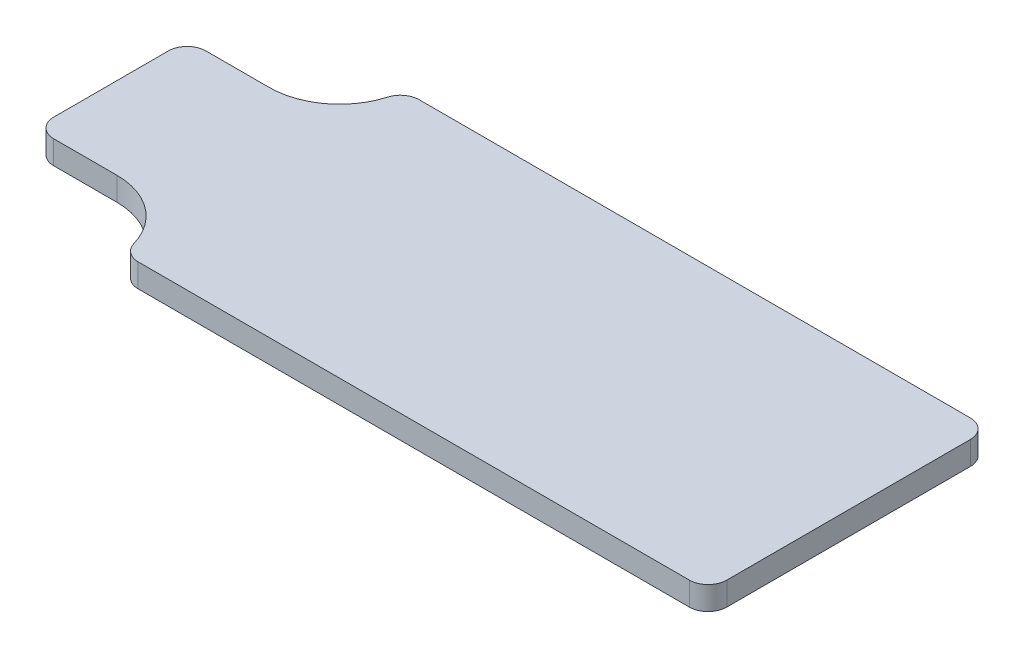
ISO-10303-21;
HEADER;
FILE_DESCRIPTION(('STEP AP214'),'2;1');
FILE_NAME('part.step','',(''),(''),'','','');
FILE_SCHEMA(('AUTOMOTIVE_DESIGN { 1 0 10303 214 1 1 1 1 }'));
ENDSEC;
DATA;
#1=APPLICATION_CONTEXT('core data for automotive mechanical design processes');
#2=APPLICATION_PROTOCOL_DEFINITION('international standard','automotive_design',2000,#1);
#3=PRODUCT_CONTEXT('',#1,'mechanical');
#4=PRODUCT('Part','Part','',(#3));
#5=PRODUCT_RELATED_PRODUCT_CATEGORY('part','',(#4));
#6=PRODUCT_DEFINITION_FORMATION('','',#4);
#7=PRODUCT_DEFINITION_CONTEXT('part definition',#1,'design');
#8=PRODUCT_DEFINITION('design','',#6,#7);
#9=PRODUCT_DEFINITION_SHAPE('','',#8);
#10=(LENGTH_UNIT() NAMED_UNIT(*) SI_UNIT(.MILLI.,.METRE.));
#11=(NAMED_UNIT(*) PLANE_ANGLE_UNIT() SI_UNIT($,.RADIAN.));
#12=(NAMED_UNIT(*) SI_UNIT($,.STERADIAN.) SOLID_ANGLE_UNIT());
#13=UNCERTAINTY_MEASURE_WITH_UNIT(LENGTH_MEASURE(1.E-05),#10,'distance_accuracy_value','');
#14=(GEOMETRIC_REPRESENTATION_CONTEXT(3) GLOBAL_UNCERTAINTY_ASSIGNED_CONTEXT((#13)) GLOBAL_UNIT_ASSIGNED_CONTEXT((#10,
#11,#12)) REPRESENTATION_CONTEXT('',''));
#15=CARTESIAN_POINT('',(0.,0.,0.));
#16=DIRECTION('',(0.,0.,1.));
#17=DIRECTION('',(1.,0.,0.));
#18=AXIS2_PLACEMENT_3D('',#15,#16,#17);
#19=CARTESIAN_POINT('',(-65.,10.,-92.5));
#20=DIRECTION('',(1.,0.,0.));
#21=DIRECTION('',(0.,0.,-1.));
#22=AXIS2_PLACEMENT_3D('',#19,#20,#21);
#23=PLANE('',#22);
#24=DIRECTION('',(0.,0.,1.));
#25=VECTOR('',#24,1.);
#26=CARTESIAN_POINT('',(-65.,10.,-92.5));
#27=LINE('',#26,#25);
#28=CARTESIAN_POINT('',(-65.,10.,-84.5));
#29=VERTEX_POINT('',#28);
#30=CARTESIAN_POINT('',(-65.,10.,-35.5));
#31=VERTEX_POINT('',#30);
#32=EDGE_CURVE('E146',#29,#31,#27,.T.);
#33=ORIENTED_EDGE('',*,*,#32,.F.);
#34=DIRECTION('',(0.,-1.,0.));
#35=VECTOR('',#34,1.);
#36=CARTESIAN_POINT('',(-65.,10.,-84.5));
#37=LINE('',#36,#35);
#38=CARTESIAN_POINT('',(-65.,0.,-84.5));
#39=VERTEX_POINT('',#38);
#40=EDGE_CURVE('E240',#29,#39,#37,.T.);
#41=ORIENTED_EDGE('',*,*,#40,.T.);
#42=DIRECTION('',(0.,0.,1.));
#43=VECTOR('',#42,1.);
#44=CARTESIAN_POINT('',(-65.,0.,-92.5));
#45=LINE('',#44,#43);
#46=CARTESIAN_POINT('',(-65.,0.,-35.5));
#47=VERTEX_POINT('',#46);
#48=EDGE_CURVE('E177',#39,#47,#45,.T.);
#49=ORIENTED_EDGE('',*,*,#48,.T.);
#50=DIRECTION('',(0.,-1.,0.));
#51=VECTOR('',#50,1.);
#52=CARTESIAN_POINT('',(-65.,10.,-35.5));
#53=LINE('',#52,#51);
#54=EDGE_CURVE('E238',#47,#31,#53,.F.);
#55=ORIENTED_EDGE('',*,*,#54,.T.);
#56=EDGE_LOOP('',(#33,#41,#49,#55));
#57=FACE_BOUND('',#56,.T.);
#58=ADVANCED_FACE('F33',(#57),#23,.F.);
#59=CARTESIAN_POINT('',(-65.,10.,-27.5));
#60=DIRECTION('',(0.,0.,-1.));
#61=DIRECTION('',(-1.,0.,0.));
#62=AXIS2_PLACEMENT_3D('',#59,#60,#61);
#63=PLANE('',#62);
#64=DIRECTION('',(1.,0.,0.));
#65=VECTOR('',#64,1.);
#66=CARTESIAN_POINT('',(-65.,10.,-27.5));
#67=LINE('',#66,#65);
#68=CARTESIAN_POINT('',(-57.,10.,-27.5));
#69=VERTEX_POINT('',#68);
#70=CARTESIAN_POINT('',(-30.,10.,-27.5));
#71=VERTEX_POINT('',#70);
#72=EDGE_CURVE('E135',#69,#71,#67,.T.);
#73=ORIENTED_EDGE('',*,*,#72,.F.);
#74=DIRECTION('',(0.,-1.,0.));
#75=VECTOR('',#74,1.);
#76=CARTESIAN_POINT('',(-57.,10.,-27.5));
#77=LINE('',#76,#75);
#78=CARTESIAN_POINT('',(-57.,0.,-27.5));
#79=VERTEX_POINT('',#78);
#80=EDGE_CURVE('E11',#69,#79,#77,.T.);
#81=ORIENTED_EDGE('',*,*,#80,.T.);
#82=DIRECTION('',(1.,0.,0.));
#83=VECTOR('',#82,1.);
#84=CARTESIAN_POINT('',(-65.,0.,-27.5));
#85=LINE('',#84,#83);
#86=CARTESIAN_POINT('',(-30.,0.,-27.5));
#87=VERTEX_POINT('',#86);
#88=EDGE_CURVE('E152',#79,#87,#85,.T.);
#89=ORIENTED_EDGE('',*,*,#88,.T.);
#90=DIRECTION('',(0.,-1.,0.));
#91=VECTOR('',#90,1.);
#92=CARTESIAN_POINT('',(-30.,10.,-27.5));
#93=LINE('',#92,#91);
#94=EDGE_CURVE('E149',#71,#87,#93,.T.);
#95=ORIENTED_EDGE('',*,*,#94,.F.);
#96=EDGE_LOOP('',(#73,#81,#89,#95));
#97=FACE_BOUND('',#96,.T.);
#98=ADVANCED_FACE('F150',(#97),#63,.F.);
#99=CARTESIAN_POINT('',(-30.,10.,2.61363636363637));
#100=DIRECTION('',(0.,-1.,0.));
#101=DIRECTION('',(0.,0.,-1.));
#102=AXIS2_PLACEMENT_3D('',#99,#100,#101);
#103=CYLINDRICAL_SURFACE('',#102,30.1136363636364);
#104=CARTESIAN_POINT('',(-30.,0.,2.61363636363637));
#105=DIRECTION('',(0.,-1.,0.));
#106=DIRECTION('',(0.,0.,-1.));
#107=AXIS2_PLACEMENT_3D('',#104,#105,#106);
#108=CIRCLE('',#107,30.1136363636364);
#109=CARTESIAN_POINT('',(-1.07754094993066,0.,-5.77221228384019));
#110=VERTEX_POINT('',#109);
#111=EDGE_CURVE('E181',#87,#110,#108,.T.);
#112=ORIENTED_EDGE('',*,*,#111,.T.);
#113=DIRECTION('',(0.,-1.,0.));
#114=VECTOR('',#113,1.);
#115=CARTESIAN_POINT('',(-1.07754094993066,10.,-5.77221228384019));
#116=LINE('',#115,#114);
#117=CARTESIAN_POINT('',(-1.07754094993066,10.,-5.77221228384019));
#118=VERTEX_POINT('',#117);
#119=EDGE_CURVE('E161',#110,#118,#116,.F.);
#120=ORIENTED_EDGE('',*,*,#119,.T.);
#121=CARTESIAN_POINT('',(-30.,10.,2.61363636363637));
#122=DIRECTION('',(0.,-1.,0.));
#123=DIRECTION('',(0.,0.,-1.));
#124=AXIS2_PLACEMENT_3D('',#121,#122,#123);
#125=CIRCLE('',#124,30.1136363636364);
#126=EDGE_CURVE('E139',#71,#118,#125,.T.);
#127=ORIENTED_EDGE('',*,*,#126,.F.);
#128=ORIENTED_EDGE('',*,*,#94,.T.);
#129=EDGE_LOOP('',(#112,#120,#127,#128));
#130=FACE_BOUND('',#129,.T.);
#131=ADVANCED_FACE('F159',(#130),#103,.F.);
#132=CARTESIAN_POINT('',(0.,10.,0.));
#133=DIRECTION('',(0.,0.,-1.));
#134=DIRECTION('',(-1.,0.,0.));
#135=AXIS2_PLACEMENT_3D('',#132,#133,#134);
#136=PLANE('',#135);
#137=DIRECTION('',(1.,0.,0.));
#138=VECTOR('',#137,1.);
#139=CARTESIAN_POINT('',(0.,10.,0.));
#140=LINE('',#139,#138);
#141=CARTESIAN_POINT('',(6.60601043544625,10.,0.));
#142=VERTEX_POINT('',#141);
#143=CARTESIAN_POINT('',(242.,10.,0.));
#144=VERTEX_POINT('',#143);
#145=EDGE_CURVE('E162',#142,#144,#140,.T.);
#146=ORIENTED_EDGE('',*,*,#145,.F.);
#147=DIRECTION('',(0.,-1.,0.));
#148=VECTOR('',#147,1.);
#149=CARTESIAN_POINT('',(6.60601043544625,10.,0.));
#150=LINE('',#149,#148);
#151=CARTESIAN_POINT('',(6.60601043544625,0.,0.));
#152=VERTEX_POINT('',#151);
#153=EDGE_CURVE('E199',#142,#152,#150,.T.);
#154=ORIENTED_EDGE('',*,*,#153,.T.);
#155=DIRECTION('',(1.,0.,0.));
#156=VECTOR('',#155,1.);
#157=CARTESIAN_POINT('',(0.,0.,0.));
#158=LINE('',#157,#156);
#159=CARTESIAN_POINT('',(242.,0.,0.));
#160=VERTEX_POINT('',#159);
#161=EDGE_CURVE('E183',#152,#160,#158,.T.);
#162=ORIENTED_EDGE('',*,*,#161,.T.);
#163=DIRECTION('',(0.,-1.,0.));
#164=VECTOR('',#163,1.);
#165=CARTESIAN_POINT('',(242.,10.,0.));
#166=LINE('',#165,#164);
#167=EDGE_CURVE('E156',#160,#144,#166,.F.);
#168=ORIENTED_EDGE('',*,*,#167,.T.);
#169=EDGE_LOOP('',(#146,#154,#162,#168));
#170=FACE_BOUND('',#169,.T.);
#171=ADVANCED_FACE('F314',(#170),#136,.F.);
#172=CARTESIAN_POINT('',(250.,10.,-120.));
#173=DIRECTION('',(-1.,0.,0.));
#174=DIRECTION('',(0.,0.,1.));
#175=AXIS2_PLACEMENT_3D('',#172,#173,#174);
#176=PLANE('',#175);
#177=DIRECTION('',(0.,0.,-1.));
#178=VECTOR('',#177,1.);
#179=CARTESIAN_POINT('',(250.,10.,-120.));
#180=LINE('',#179,#178);
#181=CARTESIAN_POINT('',(250.,10.,-8.00000000000001));
#182=VERTEX_POINT('',#181);
#183=CARTESIAN_POINT('',(250.,10.,-112.));
#184=VERTEX_POINT('',#183);
#185=EDGE_CURVE('E165',#182,#184,#180,.T.);
#186=ORIENTED_EDGE('',*,*,#185,.F.);
#187=DIRECTION('',(0.,-1.,0.));
#188=VECTOR('',#187,1.);
#189=CARTESIAN_POINT('',(250.,10.,-8.00000000000001));
#190=LINE('',#189,#188);
#191=CARTESIAN_POINT('',(250.,0.,-8.00000000000001));
#192=VERTEX_POINT('',#191);
#193=EDGE_CURVE('E227',#182,#192,#190,.T.);
#194=ORIENTED_EDGE('',*,*,#193,.T.);
#195=DIRECTION('',(0.,0.,-1.));
#196=VECTOR('',#195,1.);
#197=CARTESIAN_POINT('',(250.,0.,-120.));
#198=LINE('',#197,#196);
#199=CARTESIAN_POINT('',(250.,0.,-112.));
#200=VERTEX_POINT('',#199);
#201=EDGE_CURVE('E186',#192,#200,#198,.T.);
#202=ORIENTED_EDGE('',*,*,#201,.T.);
#203=DIRECTION('',(0.,-1.,0.));
#204=VECTOR('',#203,1.);
#205=CARTESIAN_POINT('',(250.,10.,-112.));
#206=LINE('',#205,#204);
#207=EDGE_CURVE('E225',#200,#184,#206,.F.);
#208=ORIENTED_EDGE('',*,*,#207,.T.);
#209=EDGE_LOOP('',(#186,#194,#202,#208));
#210=FACE_BOUND('',#209,.T.);
#211=ADVANCED_FACE('F311',(#210),#176,.F.);
#212=CARTESIAN_POINT('',(0.,10.,-120.));
#213=DIRECTION('',(0.,0.,1.));
#214=DIRECTION('',(1.,0.,0.));
#215=AXIS2_PLACEMENT_3D('',#212,#213,#214);
#216=PLANE('',#215);
#217=DIRECTION('',(-1.,0.,0.));
#218=VECTOR('',#217,1.);
#219=CARTESIAN_POINT('',(0.,10.,-120.));
#220=LINE('',#219,#218);
#221=CARTESIAN_POINT('',(242.,10.,-120.));
#222=VERTEX_POINT('',#221);
#223=CARTESIAN_POINT('',(6.60601043544625,10.,-120.));
#224=VERTEX_POINT('',#223);
#225=EDGE_CURVE('E171',#222,#224,#220,.T.);
#226=ORIENTED_EDGE('',*,*,#225,.F.);
#227=DIRECTION('',(0.,-1.,0.));
#228=VECTOR('',#227,1.);
#229=CARTESIAN_POINT('',(242.,10.,-120.));
#230=LINE('',#229,#228);
#231=CARTESIAN_POINT('',(242.,0.,-120.));
#232=VERTEX_POINT('',#231);
#233=EDGE_CURVE('E232',#222,#232,#230,.T.);
#234=ORIENTED_EDGE('',*,*,#233,.T.);
#235=DIRECTION('',(-1.,0.,0.));
#236=VECTOR('',#235,1.);
#237=CARTESIAN_POINT('',(0.,0.,-120.));
#238=LINE('',#237,#236);
#239=CARTESIAN_POINT('',(6.60601043544625,0.,-120.));
#240=VERTEX_POINT('',#239);
#241=EDGE_CURVE('E189',#232,#240,#238,.T.);
#242=ORIENTED_EDGE('',*,*,#241,.T.);
#243=DIRECTION('',(0.,-1.,0.));
#244=VECTOR('',#243,1.);
#245=CARTESIAN_POINT('',(6.60601043544625,10.,-120.));
#246=LINE('',#245,#244);
#247=EDGE_CURVE('E230',#240,#224,#246,.F.);
#248=ORIENTED_EDGE('',*,*,#247,.T.);
#249=EDGE_LOOP('',(#226,#234,#242,#248));
#250=FACE_BOUND('',#249,.T.);
#251=ADVANCED_FACE('F290',(#250),#216,.F.);
#252=CARTESIAN_POINT('',(-30.,10.,-122.613636363636));
#253=DIRECTION('',(0.,-1.,0.));
#254=DIRECTION('',(0.,0.,-1.));
#255=AXIS2_PLACEMENT_3D('',#252,#253,#254);
#256=CYLINDRICAL_SURFACE('',#255,30.1136363636363);
#257=CARTESIAN_POINT('',(-30.,10.,-122.613636363636));
#258=DIRECTION('',(0.,-1.,0.));
#259=DIRECTION('',(0.,0.,1.));
#260=AXIS2_PLACEMENT_3D('',#257,#258,#259);
#261=CIRCLE('',#260,30.1136363636363);
#262=CARTESIAN_POINT('',(-1.07754094993066,10.,-114.22778771616));
#263=VERTEX_POINT('',#262);
#264=CARTESIAN_POINT('',(-30.,10.,-92.5));
#265=VERTEX_POINT('',#264);
#266=EDGE_CURVE('E173',#263,#265,#261,.T.);
#267=ORIENTED_EDGE('',*,*,#266,.F.);
#268=DIRECTION('',(0.,-1.,0.));
#269=VECTOR('',#268,1.);
#270=CARTESIAN_POINT('',(-1.07754094993066,10.,-114.22778771616));
#271=LINE('',#270,#269);
#272=CARTESIAN_POINT('',(-1.07754094993066,0.,-114.22778771616));
#273=VERTEX_POINT('',#272);
#274=EDGE_CURVE('E235',#263,#273,#271,.T.);
#275=ORIENTED_EDGE('',*,*,#274,.T.);
#276=CARTESIAN_POINT('',(-30.,0.,-122.613636363636));
#277=DIRECTION('',(0.,-1.,0.));
#278=DIRECTION('',(0.,0.,1.));
#279=AXIS2_PLACEMENT_3D('',#276,#277,#278);
#280=CIRCLE('',#279,30.1136363636363);
#281=CARTESIAN_POINT('',(-30.,0.,-92.5));
#282=VERTEX_POINT('',#281);
#283=EDGE_CURVE('E192',#273,#282,#280,.T.);
#284=ORIENTED_EDGE('',*,*,#283,.T.);
#285=DIRECTION('',(0.,-1.,0.));
#286=VECTOR('',#285,1.);
#287=CARTESIAN_POINT('',(-30.,10.,-92.5));
#288=LINE('',#287,#286);
#289=EDGE_CURVE('E157',#265,#282,#288,.T.);
#290=ORIENTED_EDGE('',*,*,#289,.F.);
#291=EDGE_LOOP('',(#267,#275,#284,#290));
#292=FACE_BOUND('',#291,.T.);
#293=ADVANCED_FACE('F296',(#292),#256,.F.);
#294=CARTESIAN_POINT('',(-65.,10.,-92.5));
#295=DIRECTION('',(0.,0.,1.));
#296=DIRECTION('',(1.,0.,0.));
#297=AXIS2_PLACEMENT_3D('',#294,#295,#296);
#298=PLANE('',#297);
#299=DIRECTION('',(-1.,0.,0.));
#300=VECTOR('',#299,1.);
#301=CARTESIAN_POINT('',(-65.,0.,-92.5));
#302=LINE('',#301,#300);
#303=CARTESIAN_POINT('',(-57.,0.,-92.5));
#304=VERTEX_POINT('',#303);
#305=EDGE_CURVE('E194',#282,#304,#302,.T.);
#306=ORIENTED_EDGE('',*,*,#305,.T.);
#307=DIRECTION('',(0.,-1.,0.));
#308=VECTOR('',#307,1.);
#309=CARTESIAN_POINT('',(-57.,10.,-92.5));
#310=LINE('',#309,#308);
#311=CARTESIAN_POINT('',(-57.,10.,-92.5));
#312=VERTEX_POINT('',#311);
#313=EDGE_CURVE('E41',#304,#312,#310,.F.);
#314=ORIENTED_EDGE('',*,*,#313,.T.);
#315=DIRECTION('',(-1.,0.,0.));
#316=VECTOR('',#315,1.);
#317=CARTESIAN_POINT('',(-65.,10.,-92.5));
#318=LINE('',#317,#316);
#319=EDGE_CURVE('E175',#265,#312,#318,.T.);
#320=ORIENTED_EDGE('',*,*,#319,.F.);
#321=ORIENTED_EDGE('',*,*,#289,.T.);
#322=EDGE_LOOP('',(#306,#314,#320,#321));
#323=FACE_BOUND('',#322,.T.);
#324=ADVANCED_FACE('F298',(#323),#298,.F.);
#325=CARTESIAN_POINT('',(-30.,10.,2.61363636363637));
#326=DIRECTION('',(0.,-1.,0.));
#327=DIRECTION('',(0.,0.,-1.));
#328=AXIS2_PLACEMENT_3D('',#325,#326,#327);
#329=PLANE('',#328);
#330=ORIENTED_EDGE('',*,*,#126,.T.);
#331=CARTESIAN_POINT('',(6.60601043544625,10.,-8.));
#332=DIRECTION('',(0.,-1.,0.));
#333=DIRECTION('',(0.,0.,-1.));
#334=AXIS2_PLACEMENT_3D('',#331,#332,#333);
#335=CIRCLE('',#334,8.);
#336=EDGE_CURVE('E223',#118,#142,#335,.F.);
#337=ORIENTED_EDGE('',*,*,#336,.T.);
#338=ORIENTED_EDGE('',*,*,#145,.T.);
#339=CARTESIAN_POINT('',(242.,10.,-8.00000000000001));
#340=DIRECTION('',(0.,-1.,0.));
#341=DIRECTION('',(0.,0.,-1.));
#342=AXIS2_PLACEMENT_3D('',#339,#340,#341);
#343=CIRCLE('',#342,8.);
#344=EDGE_CURVE('E221',#144,#182,#343,.F.);
#345=ORIENTED_EDGE('',*,*,#344,.T.);
#346=ORIENTED_EDGE('',*,*,#185,.T.);
#347=CARTESIAN_POINT('',(242.,10.,-112.));
#348=DIRECTION('',(0.,-1.,0.));
#349=DIRECTION('',(0.,0.,-1.));
#350=AXIS2_PLACEMENT_3D('',#347,#348,#349);
#351=CIRCLE('',#350,8.);
#352=EDGE_CURVE('E219',#184,#222,#351,.F.);
#353=ORIENTED_EDGE('',*,*,#352,.T.);
#354=ORIENTED_EDGE('',*,*,#225,.T.);
#355=CARTESIAN_POINT('',(6.60601043544625,10.,-112.));
#356=DIRECTION('',(0.,-1.,0.));
#357=DIRECTION('',(0.,0.,-1.));
#358=AXIS2_PLACEMENT_3D('',#355,#356,#357);
#359=CIRCLE('',#358,8.);
#360=EDGE_CURVE('E55',#224,#263,#359,.F.);
#361=ORIENTED_EDGE('',*,*,#360,.T.);
#362=ORIENTED_EDGE('',*,*,#266,.T.);
#363=ORIENTED_EDGE('',*,*,#319,.T.);
#364=CARTESIAN_POINT('',(-57.,10.,-84.5));
#365=DIRECTION('',(0.,-1.,0.));
#366=DIRECTION('',(0.,0.,-1.));
#367=AXIS2_PLACEMENT_3D('',#364,#365,#366);
#368=CIRCLE('',#367,8.);
#369=EDGE_CURVE('E216',#312,#29,#368,.F.);
#370=ORIENTED_EDGE('',*,*,#369,.T.);
#371=ORIENTED_EDGE('',*,*,#32,.T.);
#372=CARTESIAN_POINT('',(-57.,10.,-35.5));
#373=DIRECTION('',(0.,-1.,0.));
#374=DIRECTION('',(0.,0.,-1.));
#375=AXIS2_PLACEMENT_3D('',#372,#373,#374);
#376=CIRCLE('',#375,8.);
#377=EDGE_CURVE('E143',#31,#69,#376,.F.);
#378=ORIENTED_EDGE('',*,*,#377,.T.);
#379=ORIENTED_EDGE('',*,*,#72,.T.);
#380=EDGE_LOOP('',(#330,#337,#338,#345,#346,#353,#354,#361,#362,#363,#370,#371,#378,#379));
#381=FACE_BOUND('',#380,.T.);
#382=ADVANCED_FACE('F137',(#381),#329,.F.);
#383=CARTESIAN_POINT('',(-30.,0.,2.61363636363637));
#384=DIRECTION('',(0.,-1.,0.));
#385=DIRECTION('',(0.,0.,-1.));
#386=AXIS2_PLACEMENT_3D('',#383,#384,#385);
#387=PLANE('',#386);
#388=ORIENTED_EDGE('',*,*,#161,.F.);
#389=CARTESIAN_POINT('',(6.60601043544625,0.,-8.));
#390=DIRECTION('',(0.,-1.,0.));
#391=DIRECTION('',(0.,0.,-1.));
#392=AXIS2_PLACEMENT_3D('',#389,#390,#391);
#393=CIRCLE('',#392,8.);
#394=EDGE_CURVE('E212',#152,#110,#393,.T.);
#395=ORIENTED_EDGE('',*,*,#394,.T.);
#396=ORIENTED_EDGE('',*,*,#111,.F.);
#397=ORIENTED_EDGE('',*,*,#88,.F.);
#398=CARTESIAN_POINT('',(-57.,0.,-35.5));
#399=DIRECTION('',(0.,-1.,0.));
#400=DIRECTION('',(0.,0.,-1.));
#401=AXIS2_PLACEMENT_3D('',#398,#399,#400);
#402=CIRCLE('',#401,8.);
#403=EDGE_CURVE('E202',#79,#47,#402,.T.);
#404=ORIENTED_EDGE('',*,*,#403,.T.);
#405=ORIENTED_EDGE('',*,*,#48,.F.);
#406=CARTESIAN_POINT('',(-57.,0.,-84.5));
#407=DIRECTION('',(0.,-1.,0.));
#408=DIRECTION('',(0.,0.,-1.));
#409=AXIS2_PLACEMENT_3D('',#406,#407,#408);
#410=CIRCLE('',#409,8.);
#411=EDGE_CURVE('E204',#39,#304,#410,.T.);
#412=ORIENTED_EDGE('',*,*,#411,.T.);
#413=ORIENTED_EDGE('',*,*,#305,.F.);
#414=ORIENTED_EDGE('',*,*,#283,.F.);
#415=CARTESIAN_POINT('',(6.60601043544625,0.,-112.));
#416=DIRECTION('',(0.,-1.,0.));
#417=DIRECTION('',(0.,0.,-1.));
#418=AXIS2_PLACEMENT_3D('',#415,#416,#417);
#419=CIRCLE('',#418,8.);
#420=EDGE_CURVE('E206',#273,#240,#419,.T.);
#421=ORIENTED_EDGE('',*,*,#420,.T.);
#422=ORIENTED_EDGE('',*,*,#241,.F.);
#423=CARTESIAN_POINT('',(242.,0.,-112.));
#424=DIRECTION('',(0.,-1.,0.));
#425=DIRECTION('',(0.,0.,-1.));
#426=AXIS2_PLACEMENT_3D('',#423,#424,#425);
#427=CIRCLE('',#426,8.);
#428=EDGE_CURVE('E208',#232,#200,#427,.T.);
#429=ORIENTED_EDGE('',*,*,#428,.T.);
#430=ORIENTED_EDGE('',*,*,#201,.F.);
#431=CARTESIAN_POINT('',(242.,0.,-8.00000000000001));
#432=DIRECTION('',(0.,-1.,0.));
#433=DIRECTION('',(0.,0.,-1.));
#434=AXIS2_PLACEMENT_3D('',#431,#432,#433);
#435=CIRCLE('',#434,8.);
#436=EDGE_CURVE('E210',#192,#160,#435,.T.);
#437=ORIENTED_EDGE('',*,*,#436,.T.);
#438=EDGE_LOOP('',(#388,#395,#396,#397,#404,#405,#412,#413,#414,#421,#422,#429,#430,#437));
#439=FACE_BOUND('',#438,.T.);
#440=ADVANCED_FACE('F251',(#439),#387,.T.);
#441=CARTESIAN_POINT('',(6.60601043544625,10.,-8.));
#442=DIRECTION('',(0.,-1.,0.));
#443=DIRECTION('',(0.,0.,-1.));
#444=AXIS2_PLACEMENT_3D('',#441,#442,#443);
#445=CYLINDRICAL_SURFACE('',#444,8.);
#446=ORIENTED_EDGE('',*,*,#336,.F.);
#447=ORIENTED_EDGE('',*,*,#119,.F.);
#448=ORIENTED_EDGE('',*,*,#394,.F.);
#449=ORIENTED_EDGE('',*,*,#153,.F.);
#450=EDGE_LOOP('',(#446,#447,#448,#449));
#451=FACE_BOUND('',#450,.T.);
#452=ADVANCED_FACE('F272',(#451),#445,.T.);
#453=CARTESIAN_POINT('',(242.,10.,-8.00000000000001));
#454=DIRECTION('',(0.,-1.,0.));
#455=DIRECTION('',(0.,0.,-1.));
#456=AXIS2_PLACEMENT_3D('',#453,#454,#455);
#457=CYLINDRICAL_SURFACE('',#456,8.);
#458=ORIENTED_EDGE('',*,*,#344,.F.);
#459=ORIENTED_EDGE('',*,*,#167,.F.);
#460=ORIENTED_EDGE('',*,*,#436,.F.);
#461=ORIENTED_EDGE('',*,*,#193,.F.);
#462=EDGE_LOOP('',(#458,#459,#460,#461));
#463=FACE_BOUND('',#462,.T.);
#464=ADVANCED_FACE('F275',(#463),#457,.T.);
#465=CARTESIAN_POINT('',(242.,10.,-112.));
#466=DIRECTION('',(0.,-1.,0.));
#467=DIRECTION('',(0.,0.,-1.));
#468=AXIS2_PLACEMENT_3D('',#465,#466,#467);
#469=CYLINDRICAL_SURFACE('',#468,8.);
#470=ORIENTED_EDGE('',*,*,#352,.F.);
#471=ORIENTED_EDGE('',*,*,#207,.F.);
#472=ORIENTED_EDGE('',*,*,#428,.F.);
#473=ORIENTED_EDGE('',*,*,#233,.F.);
#474=EDGE_LOOP('',(#470,#471,#472,#473));
#475=FACE_BOUND('',#474,.T.);
#476=ADVANCED_FACE('F261',(#475),#469,.T.);
#477=CARTESIAN_POINT('',(6.60601043544625,10.,-112.));
#478=DIRECTION('',(0.,-1.,0.));
#479=DIRECTION('',(0.,0.,-1.));
#480=AXIS2_PLACEMENT_3D('',#477,#478,#479);
#481=CYLINDRICAL_SURFACE('',#480,8.);
#482=ORIENTED_EDGE('',*,*,#360,.F.);
#483=ORIENTED_EDGE('',*,*,#247,.F.);
#484=ORIENTED_EDGE('',*,*,#420,.F.);
#485=ORIENTED_EDGE('',*,*,#274,.F.);
#486=EDGE_LOOP('',(#482,#483,#484,#485));
#487=FACE_BOUND('',#486,.T.);
#488=ADVANCED_FACE('F256',(#487),#481,.T.);
#489=CARTESIAN_POINT('',(-57.,10.,-84.5));
#490=DIRECTION('',(0.,-1.,0.));
#491=DIRECTION('',(0.,0.,-1.));
#492=AXIS2_PLACEMENT_3D('',#489,#490,#491);
#493=CYLINDRICAL_SURFACE('',#492,8.);
#494=ORIENTED_EDGE('',*,*,#369,.F.);
#495=ORIENTED_EDGE('',*,*,#313,.F.);
#496=ORIENTED_EDGE('',*,*,#411,.F.);
#497=ORIENTED_EDGE('',*,*,#40,.F.);
#498=EDGE_LOOP('',(#494,#495,#496,#497));
#499=FACE_BOUND('',#498,.T.);
#500=ADVANCED_FACE('F254',(#499),#493,.T.);
#501=CARTESIAN_POINT('',(-57.,10.,-35.5));
#502=DIRECTION('',(0.,-1.,0.));
#503=DIRECTION('',(0.,0.,-1.));
#504=AXIS2_PLACEMENT_3D('',#501,#502,#503);
#505=CYLINDRICAL_SURFACE('',#504,8.);
#506=ORIENTED_EDGE('',*,*,#377,.F.);
#507=ORIENTED_EDGE('',*,*,#54,.F.);
#508=ORIENTED_EDGE('',*,*,#403,.F.);
#509=ORIENTED_EDGE('',*,*,#80,.F.);
#510=EDGE_LOOP('',(#506,#507,#508,#509));
#511=FACE_BOUND('',#510,.T.);
#512=ADVANCED_FACE('F35',(#511),#505,.T.);
#513=CLOSED_SHELL('',(#58,#98,#131,#171,#211,#251,#293,#324,#382,#440,#452,#464,#476,#488,#500,#512));
#514=MANIFOLD_SOLID_BREP('B2',#513);
#515=ADVANCED_BREP_SHAPE_REPRESENTATION('',(#18,#514),#14);
#516=SHAPE_DEFINITION_REPRESENTATION(#9,#515);
ENDSEC;
END-ISO-10303-21;
